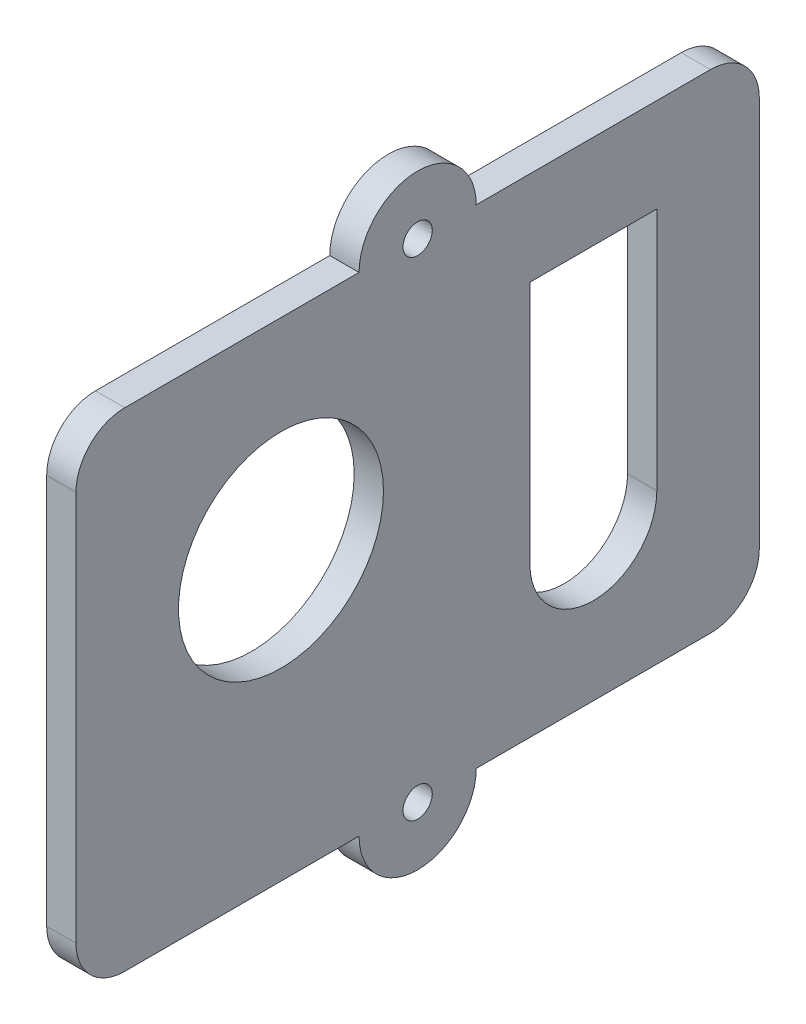
ISO-10303-21;
HEADER;
FILE_DESCRIPTION(('STEP AP214'),'2;1');
FILE_NAME('part.step','',(''),(''),'','','');
FILE_SCHEMA(('AUTOMOTIVE_DESIGN { 1 0 10303 214 1 1 1 1 }'));
ENDSEC;
DATA;
#1=APPLICATION_CONTEXT('core data for automotive mechanical design processes');
#2=APPLICATION_PROTOCOL_DEFINITION('international standard','automotive_design',2000,#1);
#3=PRODUCT_CONTEXT('',#1,'mechanical');
#4=PRODUCT('Part','Part','',(#3));
#5=PRODUCT_RELATED_PRODUCT_CATEGORY('part','',(#4));
#6=PRODUCT_DEFINITION_FORMATION('','',#4);
#7=PRODUCT_DEFINITION_CONTEXT('part definition',#1,'design');
#8=PRODUCT_DEFINITION('design','',#6,#7);
#9=PRODUCT_DEFINITION_SHAPE('','',#8);
#10=(LENGTH_UNIT() NAMED_UNIT(*) SI_UNIT(.MILLI.,.METRE.));
#11=(NAMED_UNIT(*) PLANE_ANGLE_UNIT() SI_UNIT($,.RADIAN.));
#12=(NAMED_UNIT(*) SI_UNIT($,.STERADIAN.) SOLID_ANGLE_UNIT());
#13=UNCERTAINTY_MEASURE_WITH_UNIT(LENGTH_MEASURE(1.E-05),#10,'distance_accuracy_value','');
#14=(GEOMETRIC_REPRESENTATION_CONTEXT(3) GLOBAL_UNCERTAINTY_ASSIGNED_CONTEXT((#13)) GLOBAL_UNIT_ASSIGNED_CONTEXT((#10,
#11,#12)) REPRESENTATION_CONTEXT('',''));
#15=CARTESIAN_POINT('',(0.,0.,0.));
#16=DIRECTION('',(0.,0.,1.));
#17=DIRECTION('',(1.,0.,0.));
#18=AXIS2_PLACEMENT_3D('',#15,#16,#17);
#19=CARTESIAN_POINT('',(3.,39.6176959437036,0.));
#20=DIRECTION('',(-1.,0.,0.));
#21=DIRECTION('',(0.,0.,1.));
#22=AXIS2_PLACEMENT_3D('',#19,#20,#21);
#23=CYLINDRICAL_SURFACE('',#22,6.);
#24=CARTESIAN_POINT('',(0.,39.6176959437036,0.));
#25=DIRECTION('',(1.,0.,0.));
#26=DIRECTION('',(0.,0.,-1.));
#27=AXIS2_PLACEMENT_3D('',#24,#25,#26);
#28=CIRCLE('',#27,6.);
#29=CARTESIAN_POINT('',(0.,39.6176959437036,-6.));
#30=VERTEX_POINT('',#29);
#31=CARTESIAN_POINT('',(0.,39.6176959437036,6.));
#32=VERTEX_POINT('',#31);
#33=EDGE_CURVE('E213',#30,#32,#28,.T.);
#34=ORIENTED_EDGE('',*,*,#33,.T.);
#35=DIRECTION('',(-1.,0.,0.));
#36=VECTOR('',#35,1.);
#37=CARTESIAN_POINT('',(3.,39.6176959437036,6.));
#38=LINE('',#37,#36);
#39=CARTESIAN_POINT('',(3.,39.6176959437036,6.));
#40=VERTEX_POINT('',#39);
#41=EDGE_CURVE('E11',#40,#32,#38,.T.);
#42=ORIENTED_EDGE('',*,*,#41,.F.);
#43=CARTESIAN_POINT('',(3.,39.6176959437036,0.));
#44=DIRECTION('',(1.,0.,0.));
#45=DIRECTION('',(0.,0.,-1.));
#46=AXIS2_PLACEMENT_3D('',#43,#44,#45);
#47=CIRCLE('',#46,6.);
#48=CARTESIAN_POINT('',(3.,39.6176959437036,-6.));
#49=VERTEX_POINT('',#48);
#50=EDGE_CURVE('E216',#49,#40,#47,.T.);
#51=ORIENTED_EDGE('',*,*,#50,.F.);
#52=DIRECTION('',(-1.,0.,0.));
#53=VECTOR('',#52,1.);
#54=CARTESIAN_POINT('',(3.,39.6176959437036,-6.));
#55=LINE('',#54,#53);
#56=EDGE_CURVE('E245',#49,#30,#55,.T.);
#57=ORIENTED_EDGE('',*,*,#56,.T.);
#58=EDGE_LOOP('',(#34,#42,#51,#57));
#59=FACE_BOUND('',#58,.T.);
#60=ADVANCED_FACE('F39',(#59),#23,.T.);
#61=CARTESIAN_POINT('',(3.,39.6176959437036,6.));
#62=DIRECTION('',(0.,-1.,0.));
#63=DIRECTION('',(0.,0.,-1.));
#64=AXIS2_PLACEMENT_3D('',#61,#62,#63);
#65=PLANE('',#64);
#66=DIRECTION('',(0.,0.,1.));
#67=VECTOR('',#66,1.);
#68=CARTESIAN_POINT('',(0.,39.6176959437036,6.));
#69=LINE('',#68,#67);
#70=CARTESIAN_POINT('',(0.,39.6176959437036,30.));
#71=VERTEX_POINT('',#70);
#72=EDGE_CURVE('E248',#32,#71,#69,.T.);
#73=ORIENTED_EDGE('',*,*,#72,.T.);
#74=DIRECTION('',(-1.,0.,0.));
#75=VECTOR('',#74,1.);
#76=CARTESIAN_POINT('',(3.,39.6176959437036,30.));
#77=LINE('',#76,#75);
#78=CARTESIAN_POINT('',(3.,39.6176959437036,30.));
#79=VERTEX_POINT('',#78);
#80=EDGE_CURVE('E46',#79,#71,#77,.T.);
#81=ORIENTED_EDGE('',*,*,#80,.F.);
#82=DIRECTION('',(0.,0.,1.));
#83=VECTOR('',#82,1.);
#84=CARTESIAN_POINT('',(3.,39.6176959437036,6.));
#85=LINE('',#84,#83);
#86=EDGE_CURVE('E219',#40,#79,#85,.T.);
#87=ORIENTED_EDGE('',*,*,#86,.F.);
#88=ORIENTED_EDGE('',*,*,#41,.T.);
#89=EDGE_LOOP('',(#73,#81,#87,#88));
#90=FACE_BOUND('',#89,.T.);
#91=ADVANCED_FACE('F325',(#90),#65,.F.);
#92=CARTESIAN_POINT('',(3.,34.6176959437036,30.));
#93=DIRECTION('',(-1.,0.,0.));
#94=DIRECTION('',(0.,0.,1.));
#95=AXIS2_PLACEMENT_3D('',#92,#93,#94);
#96=CYLINDRICAL_SURFACE('',#95,5.);
#97=CARTESIAN_POINT('',(0.,34.6176959437036,30.));
#98=DIRECTION('',(1.,0.,0.));
#99=DIRECTION('',(0.,0.,1.));
#100=AXIS2_PLACEMENT_3D('',#97,#98,#99);
#101=CIRCLE('',#100,5.);
#102=CARTESIAN_POINT('',(0.,34.6176959437036,35.));
#103=VERTEX_POINT('',#102);
#104=EDGE_CURVE('E250',#71,#103,#101,.T.);
#105=ORIENTED_EDGE('',*,*,#104,.T.);
#106=DIRECTION('',(-1.,0.,0.));
#107=VECTOR('',#106,1.);
#108=CARTESIAN_POINT('',(3.,34.6176959437036,35.));
#109=LINE('',#108,#107);
#110=CARTESIAN_POINT('',(3.,34.6176959437036,35.));
#111=VERTEX_POINT('',#110);
#112=EDGE_CURVE('E295',#111,#103,#109,.T.);
#113=ORIENTED_EDGE('',*,*,#112,.F.);
#114=CARTESIAN_POINT('',(3.,34.6176959437036,30.));
#115=DIRECTION('',(1.,0.,0.));
#116=DIRECTION('',(0.,0.,1.));
#117=AXIS2_PLACEMENT_3D('',#114,#115,#116);
#118=CIRCLE('',#117,5.);
#119=EDGE_CURVE('E223',#79,#111,#118,.T.);
#120=ORIENTED_EDGE('',*,*,#119,.F.);
#121=ORIENTED_EDGE('',*,*,#80,.T.);
#122=EDGE_LOOP('',(#105,#113,#120,#121));
#123=FACE_BOUND('',#122,.T.);
#124=ADVANCED_FACE('F303',(#123),#96,.T.);
#125=CARTESIAN_POINT('',(3.,34.6176959437036,35.));
#126=DIRECTION('',(0.,0.,-1.));
#127=DIRECTION('',(0.,1.,0.));
#128=AXIS2_PLACEMENT_3D('',#125,#126,#127);
#129=PLANE('',#128);
#130=DIRECTION('',(0.,-1.,0.));
#131=VECTOR('',#130,1.);
#132=CARTESIAN_POINT('',(0.,34.6176959437036,35.));
#133=LINE('',#132,#131);
#134=CARTESIAN_POINT('',(0.,-5.38230405629643,35.));
#135=VERTEX_POINT('',#134);
#136=EDGE_CURVE('E252',#103,#135,#133,.T.);
#137=ORIENTED_EDGE('',*,*,#136,.T.);
#138=DIRECTION('',(-1.,0.,0.));
#139=VECTOR('',#138,1.);
#140=CARTESIAN_POINT('',(3.,-5.38230405629643,35.));
#141=LINE('',#140,#139);
#142=CARTESIAN_POINT('',(3.,-5.38230405629643,35.));
#143=VERTEX_POINT('',#142);
#144=EDGE_CURVE('E292',#143,#135,#141,.T.);
#145=ORIENTED_EDGE('',*,*,#144,.F.);
#146=DIRECTION('',(0.,-1.,0.));
#147=VECTOR('',#146,1.);
#148=CARTESIAN_POINT('',(3.,34.6176959437036,35.));
#149=LINE('',#148,#147);
#150=EDGE_CURVE('E226',#111,#143,#149,.T.);
#151=ORIENTED_EDGE('',*,*,#150,.F.);
#152=ORIENTED_EDGE('',*,*,#112,.T.);
#153=EDGE_LOOP('',(#137,#145,#151,#152));
#154=FACE_BOUND('',#153,.T.);
#155=ADVANCED_FACE('F313',(#154),#129,.F.);
#156=CARTESIAN_POINT('',(3.,-5.38230405629643,30.));
#157=DIRECTION('',(-1.,0.,0.));
#158=DIRECTION('',(0.,0.,1.));
#159=AXIS2_PLACEMENT_3D('',#156,#157,#158);
#160=CYLINDRICAL_SURFACE('',#159,5.);
#161=CARTESIAN_POINT('',(0.,-5.38230405629643,30.));
#162=DIRECTION('',(1.,0.,0.));
#163=DIRECTION('',(0.,0.,-1.));
#164=AXIS2_PLACEMENT_3D('',#161,#162,#163);
#165=CIRCLE('',#164,5.);
#166=CARTESIAN_POINT('',(0.,-10.3823040562964,30.));
#167=VERTEX_POINT('',#166);
#168=EDGE_CURVE('E254',#135,#167,#165,.T.);
#169=ORIENTED_EDGE('',*,*,#168,.T.);
#170=DIRECTION('',(-1.,0.,0.));
#171=VECTOR('',#170,1.);
#172=CARTESIAN_POINT('',(3.,-10.3823040562964,30.));
#173=LINE('',#172,#171);
#174=CARTESIAN_POINT('',(3.,-10.3823040562964,30.));
#175=VERTEX_POINT('',#174);
#176=EDGE_CURVE('E289',#175,#167,#173,.T.);
#177=ORIENTED_EDGE('',*,*,#176,.F.);
#178=CARTESIAN_POINT('',(3.,-5.38230405629643,30.));
#179=DIRECTION('',(1.,0.,0.));
#180=DIRECTION('',(0.,0.,-1.));
#181=AXIS2_PLACEMENT_3D('',#178,#179,#180);
#182=CIRCLE('',#181,5.);
#183=EDGE_CURVE('E229',#143,#175,#182,.T.);
#184=ORIENTED_EDGE('',*,*,#183,.F.);
#185=ORIENTED_EDGE('',*,*,#144,.T.);
#186=EDGE_LOOP('',(#169,#177,#184,#185));
#187=FACE_BOUND('',#186,.T.);
#188=ADVANCED_FACE('F317',(#187),#160,.T.);
#189=CARTESIAN_POINT('',(3.,-10.3823040562964,30.));
#190=DIRECTION('',(0.,1.,0.));
#191=DIRECTION('',(0.,0.,1.));
#192=AXIS2_PLACEMENT_3D('',#189,#190,#191);
#193=PLANE('',#192);
#194=DIRECTION('',(0.,0.,-1.));
#195=VECTOR('',#194,1.);
#196=CARTESIAN_POINT('',(0.,-10.3823040562964,30.));
#197=LINE('',#196,#195);
#198=CARTESIAN_POINT('',(0.,-10.3823040562964,6.00000000000001));
#199=VERTEX_POINT('',#198);
#200=EDGE_CURVE('E256',#167,#199,#197,.T.);
#201=ORIENTED_EDGE('',*,*,#200,.T.);
#202=DIRECTION('',(-1.,0.,0.));
#203=VECTOR('',#202,1.);
#204=CARTESIAN_POINT('',(3.,-10.3823040562964,6.00000000000001));
#205=LINE('',#204,#203);
#206=CARTESIAN_POINT('',(3.,-10.3823040562964,6.00000000000001));
#207=VERTEX_POINT('',#206);
#208=EDGE_CURVE('E286',#207,#199,#205,.T.);
#209=ORIENTED_EDGE('',*,*,#208,.F.);
#210=DIRECTION('',(0.,0.,-1.));
#211=VECTOR('',#210,1.);
#212=CARTESIAN_POINT('',(3.,-10.3823040562964,30.));
#213=LINE('',#212,#211);
#214=EDGE_CURVE('E231',#175,#207,#213,.T.);
#215=ORIENTED_EDGE('',*,*,#214,.F.);
#216=ORIENTED_EDGE('',*,*,#176,.T.);
#217=EDGE_LOOP('',(#201,#209,#215,#216));
#218=FACE_BOUND('',#217,.T.);
#219=ADVANCED_FACE('F358',(#218),#193,.F.);
#220=CARTESIAN_POINT('',(3.,-10.3823040562964,0.));
#221=DIRECTION('',(-1.,0.,0.));
#222=DIRECTION('',(0.,0.,1.));
#223=AXIS2_PLACEMENT_3D('',#220,#221,#222);
#224=CYLINDRICAL_SURFACE('',#223,6.);
#225=CARTESIAN_POINT('',(0.,-10.3823040562964,0.));
#226=DIRECTION('',(1.,0.,0.));
#227=DIRECTION('',(0.,0.,-1.));
#228=AXIS2_PLACEMENT_3D('',#225,#226,#227);
#229=CIRCLE('',#228,6.);
#230=CARTESIAN_POINT('',(0.,-10.3823040562964,-6.));
#231=VERTEX_POINT('',#230);
#232=EDGE_CURVE('E258',#199,#231,#229,.T.);
#233=ORIENTED_EDGE('',*,*,#232,.T.);
#234=DIRECTION('',(-1.,0.,0.));
#235=VECTOR('',#234,1.);
#236=CARTESIAN_POINT('',(3.,-10.3823040562964,-6.));
#237=LINE('',#236,#235);
#238=CARTESIAN_POINT('',(3.,-10.3823040562964,-6.));
#239=VERTEX_POINT('',#238);
#240=EDGE_CURVE('E283',#239,#231,#237,.T.);
#241=ORIENTED_EDGE('',*,*,#240,.F.);
#242=CARTESIAN_POINT('',(3.,-10.3823040562964,0.));
#243=DIRECTION('',(1.,0.,0.));
#244=DIRECTION('',(0.,0.,-1.));
#245=AXIS2_PLACEMENT_3D('',#242,#243,#244);
#246=CIRCLE('',#245,6.);
#247=EDGE_CURVE('E233',#207,#239,#246,.T.);
#248=ORIENTED_EDGE('',*,*,#247,.F.);
#249=ORIENTED_EDGE('',*,*,#208,.T.);
#250=EDGE_LOOP('',(#233,#241,#248,#249));
#251=FACE_BOUND('',#250,.T.);
#252=ADVANCED_FACE('F356',(#251),#224,.T.);
#253=CARTESIAN_POINT('',(3.,-10.3823040562964,-6.));
#254=DIRECTION('',(0.,1.,0.));
#255=DIRECTION('',(0.,0.,1.));
#256=AXIS2_PLACEMENT_3D('',#253,#254,#255);
#257=PLANE('',#256);
#258=DIRECTION('',(0.,0.,-1.));
#259=VECTOR('',#258,1.);
#260=CARTESIAN_POINT('',(0.,-10.3823040562964,-6.));
#261=LINE('',#260,#259);
#262=CARTESIAN_POINT('',(0.,-10.3823040562964,-30.));
#263=VERTEX_POINT('',#262);
#264=EDGE_CURVE('E260',#231,#263,#261,.T.);
#265=ORIENTED_EDGE('',*,*,#264,.T.);
#266=DIRECTION('',(-1.,0.,0.));
#267=VECTOR('',#266,1.);
#268=CARTESIAN_POINT('',(3.,-10.3823040562964,-30.));
#269=LINE('',#268,#267);
#270=CARTESIAN_POINT('',(3.,-10.3823040562964,-30.));
#271=VERTEX_POINT('',#270);
#272=EDGE_CURVE('E280',#271,#263,#269,.T.);
#273=ORIENTED_EDGE('',*,*,#272,.F.);
#274=DIRECTION('',(0.,0.,-1.));
#275=VECTOR('',#274,1.);
#276=CARTESIAN_POINT('',(3.,-10.3823040562964,-6.));
#277=LINE('',#276,#275);
#278=EDGE_CURVE('E235',#239,#271,#277,.T.);
#279=ORIENTED_EDGE('',*,*,#278,.F.);
#280=ORIENTED_EDGE('',*,*,#240,.T.);
#281=EDGE_LOOP('',(#265,#273,#279,#280));
#282=FACE_BOUND('',#281,.T.);
#283=ADVANCED_FACE('F352',(#282),#257,.F.);
#284=CARTESIAN_POINT('',(3.,-5.38230405629643,-30.));
#285=DIRECTION('',(-1.,0.,0.));
#286=DIRECTION('',(0.,0.,1.));
#287=AXIS2_PLACEMENT_3D('',#284,#285,#286);
#288=CYLINDRICAL_SURFACE('',#287,5.);
#289=CARTESIAN_POINT('',(0.,-5.38230405629643,-30.));
#290=DIRECTION('',(1.,0.,0.));
#291=DIRECTION('',(0.,0.,-1.));
#292=AXIS2_PLACEMENT_3D('',#289,#290,#291);
#293=CIRCLE('',#292,5.);
#294=CARTESIAN_POINT('',(0.,-5.38230405629643,-35.));
#295=VERTEX_POINT('',#294);
#296=EDGE_CURVE('E262',#263,#295,#293,.T.);
#297=ORIENTED_EDGE('',*,*,#296,.T.);
#298=DIRECTION('',(-1.,0.,0.));
#299=VECTOR('',#298,1.);
#300=CARTESIAN_POINT('',(3.,-5.38230405629643,-35.));
#301=LINE('',#300,#299);
#302=CARTESIAN_POINT('',(3.,-5.38230405629643,-35.));
#303=VERTEX_POINT('',#302);
#304=EDGE_CURVE('E277',#303,#295,#301,.T.);
#305=ORIENTED_EDGE('',*,*,#304,.F.);
#306=CARTESIAN_POINT('',(3.,-5.38230405629643,-30.));
#307=DIRECTION('',(1.,0.,0.));
#308=DIRECTION('',(0.,0.,-1.));
#309=AXIS2_PLACEMENT_3D('',#306,#307,#308);
#310=CIRCLE('',#309,5.);
#311=EDGE_CURVE('E237',#271,#303,#310,.T.);
#312=ORIENTED_EDGE('',*,*,#311,.F.);
#313=ORIENTED_EDGE('',*,*,#272,.T.);
#314=EDGE_LOOP('',(#297,#305,#312,#313));
#315=FACE_BOUND('',#314,.T.);
#316=ADVANCED_FACE('F347',(#315),#288,.T.);
#317=CARTESIAN_POINT('',(3.,-5.38230405629643,-35.));
#318=DIRECTION('',(0.,0.,1.));
#319=DIRECTION('',(0.,-1.,0.));
#320=AXIS2_PLACEMENT_3D('',#317,#318,#319);
#321=PLANE('',#320);
#322=DIRECTION('',(0.,1.,0.));
#323=VECTOR('',#322,1.);
#324=CARTESIAN_POINT('',(0.,-5.38230405629643,-35.));
#325=LINE('',#324,#323);
#326=CARTESIAN_POINT('',(0.,34.6176959437036,-35.));
#327=VERTEX_POINT('',#326);
#328=EDGE_CURVE('E264',#295,#327,#325,.T.);
#329=ORIENTED_EDGE('',*,*,#328,.T.);
#330=DIRECTION('',(-1.,0.,0.));
#331=VECTOR('',#330,1.);
#332=CARTESIAN_POINT('',(3.,34.6176959437036,-35.));
#333=LINE('',#332,#331);
#334=CARTESIAN_POINT('',(3.,34.6176959437036,-35.));
#335=VERTEX_POINT('',#334);
#336=EDGE_CURVE('E274',#335,#327,#333,.T.);
#337=ORIENTED_EDGE('',*,*,#336,.F.);
#338=DIRECTION('',(0.,1.,0.));
#339=VECTOR('',#338,1.);
#340=CARTESIAN_POINT('',(3.,-5.38230405629643,-35.));
#341=LINE('',#340,#339);
#342=EDGE_CURVE('E239',#303,#335,#341,.T.);
#343=ORIENTED_EDGE('',*,*,#342,.F.);
#344=ORIENTED_EDGE('',*,*,#304,.T.);
#345=EDGE_LOOP('',(#329,#337,#343,#344));
#346=FACE_BOUND('',#345,.T.);
#347=ADVANCED_FACE('F341',(#346),#321,.F.);
#348=CARTESIAN_POINT('',(3.,34.6176959437036,-30.));
#349=DIRECTION('',(-1.,0.,0.));
#350=DIRECTION('',(0.,0.,1.));
#351=AXIS2_PLACEMENT_3D('',#348,#349,#350);
#352=CYLINDRICAL_SURFACE('',#351,4.99999999999999);
#353=CARTESIAN_POINT('',(0.,34.6176959437036,-30.));
#354=DIRECTION('',(1.,0.,0.));
#355=DIRECTION('',(0.,0.,1.));
#356=AXIS2_PLACEMENT_3D('',#353,#354,#355);
#357=CIRCLE('',#356,4.99999999999999);
#358=CARTESIAN_POINT('',(0.,39.6176959437036,-30.));
#359=VERTEX_POINT('',#358);
#360=EDGE_CURVE('E266',#327,#359,#357,.T.);
#361=ORIENTED_EDGE('',*,*,#360,.T.);
#362=DIRECTION('',(-1.,0.,0.));
#363=VECTOR('',#362,1.);
#364=CARTESIAN_POINT('',(3.,39.6176959437036,-30.));
#365=LINE('',#364,#363);
#366=CARTESIAN_POINT('',(3.,39.6176959437036,-30.));
#367=VERTEX_POINT('',#366);
#368=EDGE_CURVE('E271',#367,#359,#365,.T.);
#369=ORIENTED_EDGE('',*,*,#368,.F.);
#370=CARTESIAN_POINT('',(3.,34.6176959437036,-30.));
#371=DIRECTION('',(1.,0.,0.));
#372=DIRECTION('',(0.,0.,1.));
#373=AXIS2_PLACEMENT_3D('',#370,#371,#372);
#374=CIRCLE('',#373,4.99999999999999);
#375=EDGE_CURVE('E241',#335,#367,#374,.T.);
#376=ORIENTED_EDGE('',*,*,#375,.F.);
#377=ORIENTED_EDGE('',*,*,#336,.T.);
#378=EDGE_LOOP('',(#361,#369,#376,#377));
#379=FACE_BOUND('',#378,.T.);
#380=ADVANCED_FACE('F337',(#379),#352,.T.);
#381=CARTESIAN_POINT('',(3.,39.6176959437036,-30.));
#382=DIRECTION('',(0.,-1.,0.));
#383=DIRECTION('',(0.,0.,-1.));
#384=AXIS2_PLACEMENT_3D('',#381,#382,#383);
#385=PLANE('',#384);
#386=DIRECTION('',(0.,0.,1.));
#387=VECTOR('',#386,1.);
#388=CARTESIAN_POINT('',(0.,39.6176959437036,-30.));
#389=LINE('',#388,#387);
#390=EDGE_CURVE('E220',#359,#30,#389,.T.);
#391=ORIENTED_EDGE('',*,*,#390,.T.);
#392=ORIENTED_EDGE('',*,*,#56,.F.);
#393=DIRECTION('',(0.,0.,1.));
#394=VECTOR('',#393,1.);
#395=CARTESIAN_POINT('',(3.,39.6176959437036,-30.));
#396=LINE('',#395,#394);
#397=EDGE_CURVE('E243',#367,#49,#396,.T.);
#398=ORIENTED_EDGE('',*,*,#397,.F.);
#399=ORIENTED_EDGE('',*,*,#368,.T.);
#400=EDGE_LOOP('',(#391,#392,#398,#399));
#401=FACE_BOUND('',#400,.T.);
#402=ADVANCED_FACE('F332',(#401),#385,.F.);
#403=CARTESIAN_POINT('',(3.,39.6176959437036,0.));
#404=DIRECTION('',(1.,0.,0.));
#405=DIRECTION('',(0.,0.,-1.));
#406=AXIS2_PLACEMENT_3D('',#403,#404,#405);
#407=PLANE('',#406);
#408=DIRECTION('',(0.,-1.,0.));
#409=VECTOR('',#408,1.);
#410=CARTESIAN_POINT('',(3.,30.,-11.5));
#411=LINE('',#410,#409);
#412=CARTESIAN_POINT('',(3.,30.,-11.5));
#413=VERTEX_POINT('',#412);
#414=CARTESIAN_POINT('',(3.,5.,-11.5));
#415=VERTEX_POINT('',#414);
#416=EDGE_CURVE('E55',#413,#415,#411,.T.);
#417=ORIENTED_EDGE('',*,*,#416,.F.);
#418=DIRECTION('',(0.,0.,1.));
#419=VECTOR('',#418,1.);
#420=CARTESIAN_POINT('',(3.,30.,-11.5));
#421=LINE('',#420,#419);
#422=CARTESIAN_POINT('',(3.,30.,-24.5));
#423=VERTEX_POINT('',#422);
#424=EDGE_CURVE('E175',#423,#413,#421,.T.);
#425=ORIENTED_EDGE('',*,*,#424,.F.);
#426=DIRECTION('',(0.,1.,0.));
#427=VECTOR('',#426,1.);
#428=CARTESIAN_POINT('',(3.,30.,-24.5));
#429=LINE('',#428,#427);
#430=CARTESIAN_POINT('',(3.,5.,-24.5));
#431=VERTEX_POINT('',#430);
#432=EDGE_CURVE('E180',#431,#423,#429,.T.);
#433=ORIENTED_EDGE('',*,*,#432,.F.);
#434=CARTESIAN_POINT('',(3.,5.,-18.));
#435=DIRECTION('',(1.,0.,0.));
#436=DIRECTION('',(0.,0.,1.));
#437=AXIS2_PLACEMENT_3D('',#434,#435,#436);
#438=CIRCLE('',#437,6.5);
#439=EDGE_CURVE('E186',#415,#431,#438,.T.);
#440=ORIENTED_EDGE('',*,*,#439,.F.);
#441=EDGE_LOOP('',(#417,#425,#433,#440));
#442=FACE_BOUND('',#441,.T.);
#443=CARTESIAN_POINT('',(3.,19.,14.));
#444=DIRECTION('',(1.,0.,0.));
#445=DIRECTION('',(0.,0.,-1.));
#446=AXIS2_PLACEMENT_3D('',#443,#444,#445);
#447=CIRCLE('',#446,10.5);
#448=CARTESIAN_POINT('',(3.,19.,3.5));
#449=VERTEX_POINT('',#448);
#450=EDGE_CURVE('E192',#449,#449,#447,.T.);
#451=ORIENTED_EDGE('',*,*,#450,.F.);
#452=EDGE_LOOP('',(#451));
#453=FACE_BOUND('',#452,.T.);
#454=CARTESIAN_POINT('',(3.,-10.3823040562964,0.));
#455=DIRECTION('',(1.,0.,0.));
#456=DIRECTION('',(0.,0.,-1.));
#457=AXIS2_PLACEMENT_3D('',#454,#455,#456);
#458=CIRCLE('',#457,1.5);
#459=CARTESIAN_POINT('',(3.,-10.3823040562964,-1.49999999999999));
#460=VERTEX_POINT('',#459);
#461=EDGE_CURVE('E200',#460,#460,#458,.T.);
#462=ORIENTED_EDGE('',*,*,#461,.F.);
#463=EDGE_LOOP('',(#462));
#464=FACE_BOUND('',#463,.T.);
#465=CARTESIAN_POINT('',(3.,39.6176959437036,0.));
#466=DIRECTION('',(1.,0.,0.));
#467=DIRECTION('',(0.,0.,-1.));
#468=AXIS2_PLACEMENT_3D('',#465,#466,#467);
#469=CIRCLE('',#468,1.5);
#470=CARTESIAN_POINT('',(3.,39.6176959437036,-1.5));
#471=VERTEX_POINT('',#470);
#472=EDGE_CURVE('E207',#471,#471,#469,.T.);
#473=ORIENTED_EDGE('',*,*,#472,.F.);
#474=EDGE_LOOP('',(#473));
#475=FACE_BOUND('',#474,.T.);
#476=ORIENTED_EDGE('',*,*,#50,.T.);
#477=ORIENTED_EDGE('',*,*,#86,.T.);
#478=ORIENTED_EDGE('',*,*,#119,.T.);
#479=ORIENTED_EDGE('',*,*,#150,.T.);
#480=ORIENTED_EDGE('',*,*,#183,.T.);
#481=ORIENTED_EDGE('',*,*,#214,.T.);
#482=ORIENTED_EDGE('',*,*,#247,.T.);
#483=ORIENTED_EDGE('',*,*,#278,.T.);
#484=ORIENTED_EDGE('',*,*,#311,.T.);
#485=ORIENTED_EDGE('',*,*,#342,.T.);
#486=ORIENTED_EDGE('',*,*,#375,.T.);
#487=ORIENTED_EDGE('',*,*,#397,.T.);
#488=EDGE_LOOP('',(#476,#477,#478,#479,#480,#481,#482,#483,#484,#485,#486,#487));
#489=FACE_BOUND('',#488,.T.);
#490=ADVANCED_FACE('F321',(#442,#453,#464,#475,#489),#407,.T.);
#491=CARTESIAN_POINT('',(0.,39.6176959437036,0.));
#492=DIRECTION('',(1.,0.,0.));
#493=DIRECTION('',(0.,0.,-1.));
#494=AXIS2_PLACEMENT_3D('',#491,#492,#493);
#495=PLANE('',#494);
#496=DIRECTION('',(0.,0.,1.));
#497=VECTOR('',#496,1.);
#498=CARTESIAN_POINT('',(0.,30.,-11.5));
#499=LINE('',#498,#497);
#500=CARTESIAN_POINT('',(0.,30.,-24.5));
#501=VERTEX_POINT('',#500);
#502=CARTESIAN_POINT('',(0.,30.,-11.5));
#503=VERTEX_POINT('',#502);
#504=EDGE_CURVE('E163',#501,#503,#499,.T.);
#505=ORIENTED_EDGE('',*,*,#504,.T.);
#506=DIRECTION('',(0.,-1.,0.));
#507=VECTOR('',#506,1.);
#508=CARTESIAN_POINT('',(0.,30.,-11.5));
#509=LINE('',#508,#507);
#510=CARTESIAN_POINT('',(0.,5.,-11.5));
#511=VERTEX_POINT('',#510);
#512=EDGE_CURVE('E156',#503,#511,#509,.T.);
#513=ORIENTED_EDGE('',*,*,#512,.T.);
#514=CARTESIAN_POINT('',(0.,5.,-18.));
#515=DIRECTION('',(1.,0.,0.));
#516=DIRECTION('',(0.,0.,1.));
#517=AXIS2_PLACEMENT_3D('',#514,#515,#516);
#518=CIRCLE('',#517,6.5);
#519=CARTESIAN_POINT('',(0.,5.,-24.5));
#520=VERTEX_POINT('',#519);
#521=EDGE_CURVE('E166',#511,#520,#518,.T.);
#522=ORIENTED_EDGE('',*,*,#521,.T.);
#523=DIRECTION('',(0.,1.,0.));
#524=VECTOR('',#523,1.);
#525=CARTESIAN_POINT('',(0.,30.,-24.5));
#526=LINE('',#525,#524);
#527=EDGE_CURVE('E63',#520,#501,#526,.T.);
#528=ORIENTED_EDGE('',*,*,#527,.T.);
#529=EDGE_LOOP('',(#505,#513,#522,#528));
#530=FACE_BOUND('',#529,.T.);
#531=CARTESIAN_POINT('',(0.,19.,14.));
#532=DIRECTION('',(1.,0.,0.));
#533=DIRECTION('',(0.,0.,-1.));
#534=AXIS2_PLACEMENT_3D('',#531,#532,#533);
#535=CIRCLE('',#534,10.5);
#536=CARTESIAN_POINT('',(0.,19.,3.5));
#537=VERTEX_POINT('',#536);
#538=EDGE_CURVE('E196',#537,#537,#535,.T.);
#539=ORIENTED_EDGE('',*,*,#538,.T.);
#540=EDGE_LOOP('',(#539));
#541=FACE_BOUND('',#540,.T.);
#542=CARTESIAN_POINT('',(0.,-10.3823040562964,0.));
#543=DIRECTION('',(1.,0.,0.));
#544=DIRECTION('',(0.,0.,-1.));
#545=AXIS2_PLACEMENT_3D('',#542,#543,#544);
#546=CIRCLE('',#545,1.5);
#547=CARTESIAN_POINT('',(0.,-10.3823040562964,-1.49999999999999));
#548=VERTEX_POINT('',#547);
#549=EDGE_CURVE('E204',#548,#548,#546,.T.);
#550=ORIENTED_EDGE('',*,*,#549,.T.);
#551=EDGE_LOOP('',(#550));
#552=FACE_BOUND('',#551,.T.);
#553=CARTESIAN_POINT('',(0.,39.6176959437036,0.));
#554=DIRECTION('',(1.,0.,0.));
#555=DIRECTION('',(0.,0.,-1.));
#556=AXIS2_PLACEMENT_3D('',#553,#554,#555);
#557=CIRCLE('',#556,1.5);
#558=CARTESIAN_POINT('',(0.,39.6176959437036,-1.5));
#559=VERTEX_POINT('',#558);
#560=EDGE_CURVE('E210',#559,#559,#557,.T.);
#561=ORIENTED_EDGE('',*,*,#560,.T.);
#562=EDGE_LOOP('',(#561));
#563=FACE_BOUND('',#562,.T.);
#564=ORIENTED_EDGE('',*,*,#33,.F.);
#565=ORIENTED_EDGE('',*,*,#390,.F.);
#566=ORIENTED_EDGE('',*,*,#360,.F.);
#567=ORIENTED_EDGE('',*,*,#328,.F.);
#568=ORIENTED_EDGE('',*,*,#296,.F.);
#569=ORIENTED_EDGE('',*,*,#264,.F.);
#570=ORIENTED_EDGE('',*,*,#232,.F.);
#571=ORIENTED_EDGE('',*,*,#200,.F.);
#572=ORIENTED_EDGE('',*,*,#168,.F.);
#573=ORIENTED_EDGE('',*,*,#136,.F.);
#574=ORIENTED_EDGE('',*,*,#104,.F.);
#575=ORIENTED_EDGE('',*,*,#72,.F.);
#576=EDGE_LOOP('',(#564,#565,#566,#567,#568,#569,#570,#571,#572,#573,#574,#575));
#577=FACE_BOUND('',#576,.T.);
#578=ADVANCED_FACE('F171',(#530,#541,#552,#563,#577),#495,.F.);
#579=CARTESIAN_POINT('',(0.,39.6176959437036,0.));
#580=DIRECTION('',(1.,0.,0.));
#581=DIRECTION('',(0.,0.,-1.));
#582=AXIS2_PLACEMENT_3D('',#579,#580,#581);
#583=CYLINDRICAL_SURFACE('',#582,1.5);
#584=ORIENTED_EDGE('',*,*,#560,.F.);
#585=EDGE_LOOP('',(#584));
#586=FACE_BOUND('',#585,.T.);
#587=ORIENTED_EDGE('',*,*,#472,.T.);
#588=EDGE_LOOP('',(#587));
#589=FACE_BOUND('',#588,.T.);
#590=ADVANCED_FACE('F454',(#586,#589),#583,.F.);
#591=CARTESIAN_POINT('',(0.,-10.3823040562964,0.));
#592=DIRECTION('',(1.,0.,0.));
#593=DIRECTION('',(0.,0.,-1.));
#594=AXIS2_PLACEMENT_3D('',#591,#592,#593);
#595=CYLINDRICAL_SURFACE('',#594,1.5);
#596=ORIENTED_EDGE('',*,*,#549,.F.);
#597=EDGE_LOOP('',(#596));
#598=FACE_BOUND('',#597,.T.);
#599=ORIENTED_EDGE('',*,*,#461,.T.);
#600=EDGE_LOOP('',(#599));
#601=FACE_BOUND('',#600,.T.);
#602=ADVANCED_FACE('F462',(#598,#601),#595,.F.);
#603=CARTESIAN_POINT('',(0.,19.,14.));
#604=DIRECTION('',(1.,0.,0.));
#605=DIRECTION('',(0.,0.,-1.));
#606=AXIS2_PLACEMENT_3D('',#603,#604,#605);
#607=CYLINDRICAL_SURFACE('',#606,10.5);
#608=ORIENTED_EDGE('',*,*,#538,.F.);
#609=EDGE_LOOP('',(#608));
#610=FACE_BOUND('',#609,.T.);
#611=ORIENTED_EDGE('',*,*,#450,.T.);
#612=EDGE_LOOP('',(#611));
#613=FACE_BOUND('',#612,.T.);
#614=ADVANCED_FACE('F472',(#610,#613),#607,.F.);
#615=CARTESIAN_POINT('',(0.,30.,-11.5));
#616=DIRECTION('',(0.,0.,1.));
#617=DIRECTION('',(0.,-1.,0.));
#618=AXIS2_PLACEMENT_3D('',#615,#616,#617);
#619=PLANE('',#618);
#620=ORIENTED_EDGE('',*,*,#416,.T.);
#621=DIRECTION('',(1.,0.,0.));
#622=VECTOR('',#621,1.);
#623=CARTESIAN_POINT('',(0.,5.,-11.5));
#624=LINE('',#623,#622);
#625=EDGE_CURVE('E152',#511,#415,#624,.T.);
#626=ORIENTED_EDGE('',*,*,#625,.F.);
#627=ORIENTED_EDGE('',*,*,#512,.F.);
#628=DIRECTION('',(1.,0.,0.));
#629=VECTOR('',#628,1.);
#630=CARTESIAN_POINT('',(0.,30.,-11.5));
#631=LINE('',#630,#629);
#632=EDGE_CURVE('E190',#503,#413,#631,.T.);
#633=ORIENTED_EDGE('',*,*,#632,.T.);
#634=EDGE_LOOP('',(#620,#626,#627,#633));
#635=FACE_BOUND('',#634,.T.);
#636=ADVANCED_FACE('F154',(#635),#619,.F.);
#637=CARTESIAN_POINT('',(0.,30.,-11.5));
#638=DIRECTION('',(0.,1.,0.));
#639=DIRECTION('',(0.,0.,1.));
#640=AXIS2_PLACEMENT_3D('',#637,#638,#639);
#641=PLANE('',#640);
#642=ORIENTED_EDGE('',*,*,#424,.T.);
#643=ORIENTED_EDGE('',*,*,#632,.F.);
#644=ORIENTED_EDGE('',*,*,#504,.F.);
#645=DIRECTION('',(1.,0.,0.));
#646=VECTOR('',#645,1.);
#647=CARTESIAN_POINT('',(0.,30.,-24.5));
#648=LINE('',#647,#646);
#649=EDGE_CURVE('E193',#501,#423,#648,.T.);
#650=ORIENTED_EDGE('',*,*,#649,.T.);
#651=EDGE_LOOP('',(#642,#643,#644,#650));
#652=FACE_BOUND('',#651,.T.);
#653=ADVANCED_FACE('F491',(#652),#641,.F.);
#654=CARTESIAN_POINT('',(0.,30.,-24.5));
#655=DIRECTION('',(0.,0.,-1.));
#656=DIRECTION('',(-1.,0.,0.));
#657=AXIS2_PLACEMENT_3D('',#654,#655,#656);
#658=PLANE('',#657);
#659=ORIENTED_EDGE('',*,*,#432,.T.);
#660=ORIENTED_EDGE('',*,*,#649,.F.);
#661=ORIENTED_EDGE('',*,*,#527,.F.);
#662=DIRECTION('',(1.,0.,0.));
#663=VECTOR('',#662,1.);
#664=CARTESIAN_POINT('',(0.,5.,-24.5));
#665=LINE('',#664,#663);
#666=EDGE_CURVE('E162',#520,#431,#665,.T.);
#667=ORIENTED_EDGE('',*,*,#666,.T.);
#668=EDGE_LOOP('',(#659,#660,#661,#667));
#669=FACE_BOUND('',#668,.T.);
#670=ADVANCED_FACE('F500',(#669),#658,.F.);
#671=CARTESIAN_POINT('',(0.,5.,-18.));
#672=DIRECTION('',(1.,0.,0.));
#673=DIRECTION('',(0.,0.,-1.));
#674=AXIS2_PLACEMENT_3D('',#671,#672,#673);
#675=CYLINDRICAL_SURFACE('',#674,6.5);
#676=ORIENTED_EDGE('',*,*,#439,.T.);
#677=ORIENTED_EDGE('',*,*,#666,.F.);
#678=ORIENTED_EDGE('',*,*,#521,.F.);
#679=ORIENTED_EDGE('',*,*,#625,.T.);
#680=EDGE_LOOP('',(#676,#677,#678,#679));
#681=FACE_BOUND('',#680,.T.);
#682=ADVANCED_FACE('F167',(#681),#675,.F.);
#683=CLOSED_SHELL('',(#60,#91,#124,#155,#188,#219,#252,#283,#316,#347,#380,#402,#490,#578,#590,
#602,#614,#636,#653,#670,#682));
#684=MANIFOLD_SOLID_BREP('B2',#683);
#685=ADVANCED_BREP_SHAPE_REPRESENTATION('',(#18,#684),#14);
#686=SHAPE_DEFINITION_REPRESENTATION(#9,#685);
ENDSEC;
END-ISO-10303-21;
